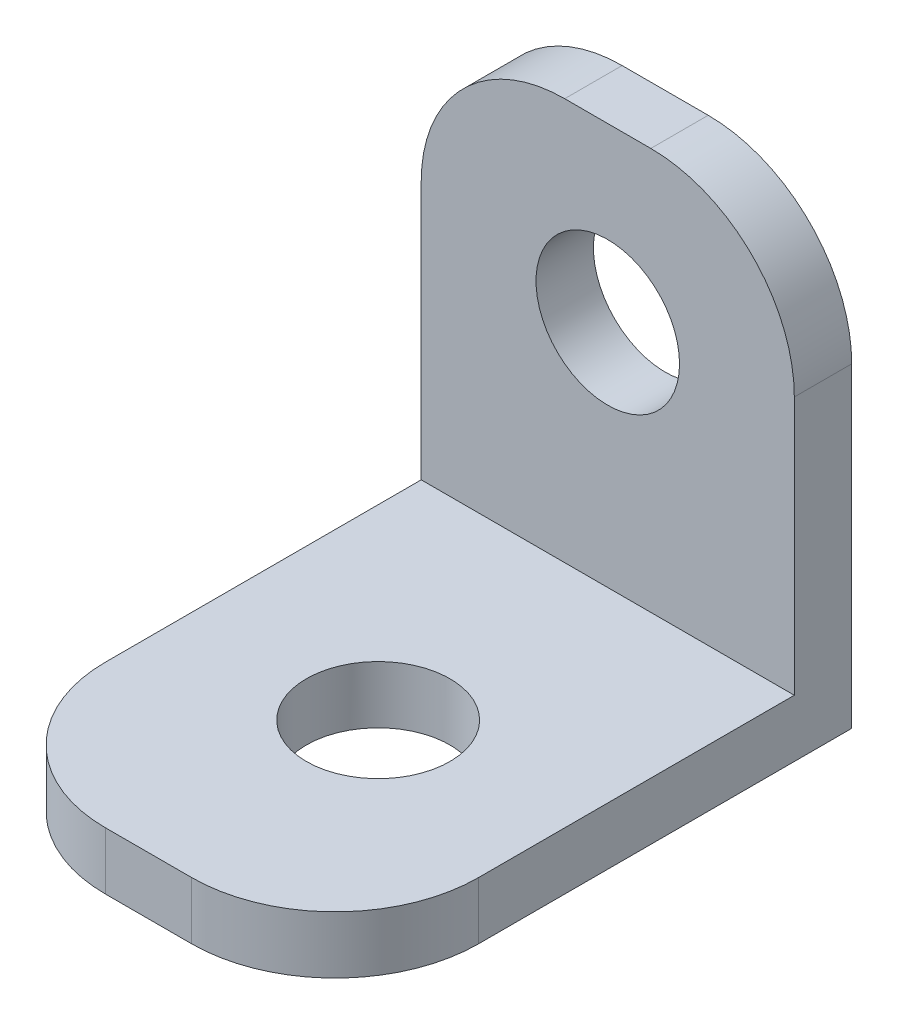
ISO-10303-21;
HEADER;
FILE_DESCRIPTION(('STEP AP214'),'2;1');
FILE_NAME('part.step','',(''),(''),'','','');
FILE_SCHEMA(('AUTOMOTIVE_DESIGN { 1 0 10303 214 1 1 1 1 }'));
ENDSEC;
DATA;
#1=APPLICATION_CONTEXT('core data for automotive mechanical design processes');
#2=APPLICATION_PROTOCOL_DEFINITION('international standard','automotive_design',2000,#1);
#3=PRODUCT_CONTEXT('',#1,'mechanical');
#4=PRODUCT('Part','Part','',(#3));
#5=PRODUCT_RELATED_PRODUCT_CATEGORY('part','',(#4));
#6=PRODUCT_DEFINITION_FORMATION('','',#4);
#7=PRODUCT_DEFINITION_CONTEXT('part definition',#1,'design');
#8=PRODUCT_DEFINITION('design','',#6,#7);
#9=PRODUCT_DEFINITION_SHAPE('','',#8);
#10=(LENGTH_UNIT() NAMED_UNIT(*) SI_UNIT(.MILLI.,.METRE.));
#11=(NAMED_UNIT(*) PLANE_ANGLE_UNIT() SI_UNIT($,.RADIAN.));
#12=(NAMED_UNIT(*) SI_UNIT($,.STERADIAN.) SOLID_ANGLE_UNIT());
#13=UNCERTAINTY_MEASURE_WITH_UNIT(LENGTH_MEASURE(1.E-05),#10,'distance_accuracy_value','');
#14=(GEOMETRIC_REPRESENTATION_CONTEXT(3) GLOBAL_UNCERTAINTY_ASSIGNED_CONTEXT((#13)) GLOBAL_UNIT_ASSIGNED_CONTEXT((#10,
#11,#12)) REPRESENTATION_CONTEXT('',''));
#15=CARTESIAN_POINT('',(0.,0.,0.));
#16=DIRECTION('',(0.,0.,1.));
#17=DIRECTION('',(1.,0.,0.));
#18=AXIS2_PLACEMENT_3D('',#15,#16,#17);
#19=CARTESIAN_POINT('',(0.,0.,2.));
#20=DIRECTION('',(0.,0.,1.));
#21=DIRECTION('',(1.,0.,0.));
#22=AXIS2_PLACEMENT_3D('',#19,#20,#21);
#23=PLANE('',#22);
#24=DIRECTION('',(-1.,0.,0.));
#25=VECTOR('',#24,1.);
#26=CARTESIAN_POINT('',(-6.5,-6.,2.));
#27=LINE('',#26,#25);
#28=CARTESIAN_POINT('',(6.5,-6.,2.));
#29=VERTEX_POINT('',#28);
#30=CARTESIAN_POINT('',(-6.5,-6.,2.));
#31=VERTEX_POINT('',#30);
#32=EDGE_CURVE('E126',#29,#31,#27,.T.);
#33=ORIENTED_EDGE('',*,*,#32,.F.);
#34=DIRECTION('',(0.,1.,0.));
#35=VECTOR('',#34,1.);
#36=CARTESIAN_POINT('',(6.5,-8.,2.));
#37=LINE('',#36,#35);
#38=CARTESIAN_POINT('',(6.5,3.,2.));
#39=VERTEX_POINT('',#38);
#40=EDGE_CURVE('E131',#29,#39,#37,.T.);
#41=ORIENTED_EDGE('',*,*,#40,.T.);
#42=CARTESIAN_POINT('',(1.5,3.,2.));
#43=DIRECTION('',(0.,0.,1.));
#44=DIRECTION('',(1.,0.,0.));
#45=AXIS2_PLACEMENT_3D('',#42,#43,#44);
#46=CIRCLE('',#45,5.);
#47=CARTESIAN_POINT('',(1.5,8.,2.));
#48=VERTEX_POINT('',#47);
#49=EDGE_CURVE('E182',#39,#48,#46,.T.);
#50=ORIENTED_EDGE('',*,*,#49,.T.);
#51=DIRECTION('',(-1.,0.,0.));
#52=VECTOR('',#51,1.);
#53=CARTESIAN_POINT('',(6.5,8.,2.));
#54=LINE('',#53,#52);
#55=CARTESIAN_POINT('',(-1.5,8.,2.));
#56=VERTEX_POINT('',#55);
#57=EDGE_CURVE('E155',#48,#56,#54,.T.);
#58=ORIENTED_EDGE('',*,*,#57,.T.);
#59=CARTESIAN_POINT('',(-1.5,3.,2.));
#60=DIRECTION('',(0.,0.,1.));
#61=DIRECTION('',(1.,0.,0.));
#62=AXIS2_PLACEMENT_3D('',#59,#60,#61);
#63=CIRCLE('',#62,5.);
#64=CARTESIAN_POINT('',(-6.5,3.,2.));
#65=VERTEX_POINT('',#64);
#66=EDGE_CURVE('E130',#56,#65,#63,.T.);
#67=ORIENTED_EDGE('',*,*,#66,.T.);
#68=DIRECTION('',(0.,-1.,0.));
#69=VECTOR('',#68,1.);
#70=CARTESIAN_POINT('',(-6.5,-8.,2.));
#71=LINE('',#70,#69);
#72=EDGE_CURVE('E114',#65,#31,#71,.T.);
#73=ORIENTED_EDGE('',*,*,#72,.T.);
#74=EDGE_LOOP('',(#33,#41,#50,#58,#67,#73));
#75=FACE_BOUND('',#74,.T.);
#76=CARTESIAN_POINT('',(0.,2.,2.));
#77=DIRECTION('',(0.,0.,1.));
#78=DIRECTION('',(1.,0.,0.));
#79=AXIS2_PLACEMENT_3D('',#76,#77,#78);
#80=CIRCLE('',#79,2.5);
#81=CARTESIAN_POINT('',(2.5,2.,2.));
#82=VERTEX_POINT('',#81);
#83=EDGE_CURVE('E148',#82,#82,#80,.T.);
#84=ORIENTED_EDGE('',*,*,#83,.F.);
#85=EDGE_LOOP('',(#84));
#86=FACE_BOUND('',#85,.T.);
#87=ADVANCED_FACE('F33',(#75,#86),#23,.T.);
#88=CARTESIAN_POINT('',(0.,0.,0.));
#89=DIRECTION('',(0.,0.,1.));
#90=DIRECTION('',(1.,0.,0.));
#91=AXIS2_PLACEMENT_3D('',#88,#89,#90);
#92=PLANE('',#91);
#93=DIRECTION('',(0.,-1.,0.));
#94=VECTOR('',#93,1.);
#95=CARTESIAN_POINT('',(-6.5,-8.,0.));
#96=LINE('',#95,#94);
#97=CARTESIAN_POINT('',(-6.5,3.,0.));
#98=VERTEX_POINT('',#97);
#99=CARTESIAN_POINT('',(-6.5,-8.,0.));
#100=VERTEX_POINT('',#99);
#101=EDGE_CURVE('E151',#98,#100,#96,.T.);
#102=ORIENTED_EDGE('',*,*,#101,.F.);
#103=CARTESIAN_POINT('',(-1.5,3.,0.));
#104=DIRECTION('',(0.,0.,1.));
#105=DIRECTION('',(1.,0.,0.));
#106=AXIS2_PLACEMENT_3D('',#103,#104,#105);
#107=CIRCLE('',#106,5.);
#108=CARTESIAN_POINT('',(-1.5,8.,0.));
#109=VERTEX_POINT('',#108);
#110=EDGE_CURVE('E175',#98,#109,#107,.F.);
#111=ORIENTED_EDGE('',*,*,#110,.T.);
#112=DIRECTION('',(-1.,0.,0.));
#113=VECTOR('',#112,1.);
#114=CARTESIAN_POINT('',(6.5,8.,0.));
#115=LINE('',#114,#113);
#116=CARTESIAN_POINT('',(1.5,8.,0.));
#117=VERTEX_POINT('',#116);
#118=EDGE_CURVE('E132',#117,#109,#115,.T.);
#119=ORIENTED_EDGE('',*,*,#118,.F.);
#120=CARTESIAN_POINT('',(1.5,3.,0.));
#121=DIRECTION('',(0.,0.,1.));
#122=DIRECTION('',(1.,0.,0.));
#123=AXIS2_PLACEMENT_3D('',#120,#121,#122);
#124=CIRCLE('',#123,5.);
#125=CARTESIAN_POINT('',(6.5,3.,0.));
#126=VERTEX_POINT('',#125);
#127=EDGE_CURVE('E173',#117,#126,#124,.F.);
#128=ORIENTED_EDGE('',*,*,#127,.T.);
#129=DIRECTION('',(0.,1.,0.));
#130=VECTOR('',#129,1.);
#131=CARTESIAN_POINT('',(6.5,-8.,0.));
#132=LINE('',#131,#130);
#133=CARTESIAN_POINT('',(6.5,-8.,0.));
#134=VERTEX_POINT('',#133);
#135=EDGE_CURVE('E163',#134,#126,#132,.T.);
#136=ORIENTED_EDGE('',*,*,#135,.F.);
#137=DIRECTION('',(1.,0.,0.));
#138=VECTOR('',#137,1.);
#139=CARTESIAN_POINT('',(6.5,-8.,0.));
#140=LINE('',#139,#138);
#141=EDGE_CURVE('E160',#100,#134,#140,.T.);
#142=ORIENTED_EDGE('',*,*,#141,.F.);
#143=EDGE_LOOP('',(#102,#111,#119,#128,#136,#142));
#144=FACE_BOUND('',#143,.T.);
#145=CARTESIAN_POINT('',(0.,2.,0.));
#146=DIRECTION('',(0.,0.,1.));
#147=DIRECTION('',(1.,0.,0.));
#148=AXIS2_PLACEMENT_3D('',#145,#146,#147);
#149=CIRCLE('',#148,2.5);
#150=CARTESIAN_POINT('',(2.5,2.,0.));
#151=VERTEX_POINT('',#150);
#152=EDGE_CURVE('E147',#151,#151,#149,.T.);
#153=ORIENTED_EDGE('',*,*,#152,.T.);
#154=EDGE_LOOP('',(#153));
#155=FACE_BOUND('',#154,.T.);
#156=ADVANCED_FACE('F222',(#144,#155),#92,.F.);
#157=CARTESIAN_POINT('',(-6.5,-8.,2.));
#158=DIRECTION('',(1.,0.,0.));
#159=DIRECTION('',(0.,0.,-1.));
#160=AXIS2_PLACEMENT_3D('',#157,#158,#159);
#161=PLANE('',#160);
#162=DIRECTION('',(0.,0.,-1.));
#163=VECTOR('',#162,1.);
#164=CARTESIAN_POINT('',(-6.5,-8.,2.));
#165=LINE('',#164,#163);
#166=CARTESIAN_POINT('',(-6.5,-8.,13.));
#167=VERTEX_POINT('',#166);
#168=EDGE_CURVE('E169',#167,#100,#165,.T.);
#169=ORIENTED_EDGE('',*,*,#168,.F.);
#170=DIRECTION('',(0.,-1.,0.));
#171=VECTOR('',#170,1.);
#172=CARTESIAN_POINT('',(-6.5,-8.,13.));
#173=LINE('',#172,#171);
#174=CARTESIAN_POINT('',(-6.5,-6.,13.));
#175=VERTEX_POINT('',#174);
#176=EDGE_CURVE('E11',#167,#175,#173,.F.);
#177=ORIENTED_EDGE('',*,*,#176,.T.);
#178=DIRECTION('',(0.,0.,-1.));
#179=VECTOR('',#178,1.);
#180=CARTESIAN_POINT('',(-6.5,-6.,18.));
#181=LINE('',#180,#179);
#182=EDGE_CURVE('E110',#175,#31,#181,.T.);
#183=ORIENTED_EDGE('',*,*,#182,.T.);
#184=ORIENTED_EDGE('',*,*,#72,.F.);
#185=DIRECTION('',(0.,0.,-1.));
#186=VECTOR('',#185,1.);
#187=CARTESIAN_POINT('',(-6.5,3.,2.));
#188=LINE('',#187,#186);
#189=EDGE_CURVE('E171',#65,#98,#188,.T.);
#190=ORIENTED_EDGE('',*,*,#189,.T.);
#191=ORIENTED_EDGE('',*,*,#101,.T.);
#192=EDGE_LOOP('',(#169,#177,#183,#184,#190,#191));
#193=FACE_BOUND('',#192,.T.);
#194=ADVANCED_FACE('F112',(#193),#161,.F.);
#195=CARTESIAN_POINT('',(6.5,-8.,2.));
#196=DIRECTION('',(0.,1.,0.));
#197=DIRECTION('',(-1.,0.,0.));
#198=AXIS2_PLACEMENT_3D('',#195,#196,#197);
#199=PLANE('',#198);
#200=CARTESIAN_POINT('',(0.,-8.,10.));
#201=DIRECTION('',(0.,1.,0.));
#202=DIRECTION('',(-1.,0.,0.));
#203=AXIS2_PLACEMENT_3D('',#200,#201,#202);
#204=CIRCLE('',#203,2.5);
#205=CARTESIAN_POINT('',(-2.5,-8.,10.));
#206=VERTEX_POINT('',#205);
#207=EDGE_CURVE('E137',#206,#206,#204,.T.);
#208=ORIENTED_EDGE('',*,*,#207,.T.);
#209=EDGE_LOOP('',(#208));
#210=FACE_BOUND('',#209,.T.);
#211=DIRECTION('',(0.,0.,-1.));
#212=VECTOR('',#211,1.);
#213=CARTESIAN_POINT('',(6.5,-8.,2.));
#214=LINE('',#213,#212);
#215=CARTESIAN_POINT('',(6.5,-8.,13.));
#216=VERTEX_POINT('',#215);
#217=EDGE_CURVE('E157',#216,#134,#214,.T.);
#218=ORIENTED_EDGE('',*,*,#217,.F.);
#219=CARTESIAN_POINT('',(1.5,-8.,13.));
#220=DIRECTION('',(0.,1.,0.));
#221=DIRECTION('',(-1.,0.,0.));
#222=AXIS2_PLACEMENT_3D('',#219,#220,#221);
#223=CIRCLE('',#222,5.);
#224=CARTESIAN_POINT('',(1.5,-8.,18.));
#225=VERTEX_POINT('',#224);
#226=EDGE_CURVE('E41',#216,#225,#223,.F.);
#227=ORIENTED_EDGE('',*,*,#226,.T.);
#228=DIRECTION('',(1.,0.,0.));
#229=VECTOR('',#228,1.);
#230=CARTESIAN_POINT('',(-6.5,-8.,18.));
#231=LINE('',#230,#229);
#232=CARTESIAN_POINT('',(-1.5,-8.,18.));
#233=VERTEX_POINT('',#232);
#234=EDGE_CURVE('E136',#233,#225,#231,.T.);
#235=ORIENTED_EDGE('',*,*,#234,.F.);
#236=CARTESIAN_POINT('',(-1.5,-8.,13.));
#237=DIRECTION('',(0.,1.,0.));
#238=DIRECTION('',(-1.,0.,0.));
#239=AXIS2_PLACEMENT_3D('',#236,#237,#238);
#240=CIRCLE('',#239,5.);
#241=EDGE_CURVE('E48',#233,#167,#240,.F.);
#242=ORIENTED_EDGE('',*,*,#241,.T.);
#243=ORIENTED_EDGE('',*,*,#168,.T.);
#244=ORIENTED_EDGE('',*,*,#141,.T.);
#245=EDGE_LOOP('',(#218,#227,#235,#242,#243,#244));
#246=FACE_BOUND('',#245,.T.);
#247=ADVANCED_FACE('F200',(#210,#246),#199,.F.);
#248=CARTESIAN_POINT('',(6.5,-8.,2.));
#249=DIRECTION('',(-1.,0.,0.));
#250=DIRECTION('',(0.,0.,1.));
#251=AXIS2_PLACEMENT_3D('',#248,#249,#250);
#252=PLANE('',#251);
#253=DIRECTION('',(0.,0.,-1.));
#254=VECTOR('',#253,1.);
#255=CARTESIAN_POINT('',(6.5,-6.,18.));
#256=LINE('',#255,#254);
#257=CARTESIAN_POINT('',(6.5,-6.,13.));
#258=VERTEX_POINT('',#257);
#259=EDGE_CURVE('E120',#258,#29,#256,.T.);
#260=ORIENTED_EDGE('',*,*,#259,.F.);
#261=DIRECTION('',(0.,1.,0.));
#262=VECTOR('',#261,1.);
#263=CARTESIAN_POINT('',(6.5,-8.,13.));
#264=LINE('',#263,#262);
#265=EDGE_CURVE('E56',#258,#216,#264,.F.);
#266=ORIENTED_EDGE('',*,*,#265,.T.);
#267=ORIENTED_EDGE('',*,*,#217,.T.);
#268=ORIENTED_EDGE('',*,*,#135,.T.);
#269=DIRECTION('',(0.,0.,-1.));
#270=VECTOR('',#269,1.);
#271=CARTESIAN_POINT('',(6.5,3.,2.));
#272=LINE('',#271,#270);
#273=EDGE_CURVE('E185',#126,#39,#272,.F.);
#274=ORIENTED_EDGE('',*,*,#273,.T.);
#275=ORIENTED_EDGE('',*,*,#40,.F.);
#276=EDGE_LOOP('',(#260,#266,#267,#268,#274,#275));
#277=FACE_BOUND('',#276,.T.);
#278=ADVANCED_FACE('F208',(#277),#252,.F.);
#279=CARTESIAN_POINT('',(6.5,8.,2.));
#280=DIRECTION('',(0.,-1.,0.));
#281=DIRECTION('',(0.,0.,-1.));
#282=AXIS2_PLACEMENT_3D('',#279,#280,#281);
#283=PLANE('',#282);
#284=ORIENTED_EDGE('',*,*,#118,.T.);
#285=DIRECTION('',(0.,0.,-1.));
#286=VECTOR('',#285,1.);
#287=CARTESIAN_POINT('',(-1.5,8.,2.));
#288=LINE('',#287,#286);
#289=EDGE_CURVE('E180',#109,#56,#288,.F.);
#290=ORIENTED_EDGE('',*,*,#289,.T.);
#291=ORIENTED_EDGE('',*,*,#57,.F.);
#292=DIRECTION('',(0.,0.,-1.));
#293=VECTOR('',#292,1.);
#294=CARTESIAN_POINT('',(1.5,8.,2.));
#295=LINE('',#294,#293);
#296=EDGE_CURVE('E177',#48,#117,#295,.T.);
#297=ORIENTED_EDGE('',*,*,#296,.T.);
#298=EDGE_LOOP('',(#284,#290,#291,#297));
#299=FACE_BOUND('',#298,.T.);
#300=ADVANCED_FACE('F215',(#299),#283,.F.);
#301=CARTESIAN_POINT('',(0.,2.,2.));
#302=DIRECTION('',(0.,0.,-1.));
#303=DIRECTION('',(-1.,0.,0.));
#304=AXIS2_PLACEMENT_3D('',#301,#302,#303);
#305=CYLINDRICAL_SURFACE('',#304,2.5);
#306=ORIENTED_EDGE('',*,*,#83,.T.);
#307=EDGE_LOOP('',(#306));
#308=FACE_BOUND('',#307,.T.);
#309=ORIENTED_EDGE('',*,*,#152,.F.);
#310=EDGE_LOOP('',(#309));
#311=FACE_BOUND('',#310,.T.);
#312=ADVANCED_FACE('F228',(#308,#311),#305,.F.);
#313=CARTESIAN_POINT('',(-1.5,3.,2.));
#314=DIRECTION('',(0.,0.,-1.));
#315=DIRECTION('',(-1.,0.,0.));
#316=AXIS2_PLACEMENT_3D('',#313,#314,#315);
#317=CYLINDRICAL_SURFACE('',#316,5.);
#318=ORIENTED_EDGE('',*,*,#66,.F.);
#319=ORIENTED_EDGE('',*,*,#289,.F.);
#320=ORIENTED_EDGE('',*,*,#110,.F.);
#321=ORIENTED_EDGE('',*,*,#189,.F.);
#322=EDGE_LOOP('',(#318,#319,#320,#321));
#323=FACE_BOUND('',#322,.T.);
#324=ADVANCED_FACE('F226',(#323),#317,.T.);
#325=CARTESIAN_POINT('',(1.5,3.,2.));
#326=DIRECTION('',(0.,0.,-1.));
#327=DIRECTION('',(-1.,0.,0.));
#328=AXIS2_PLACEMENT_3D('',#325,#326,#327);
#329=CYLINDRICAL_SURFACE('',#328,5.);
#330=ORIENTED_EDGE('',*,*,#49,.F.);
#331=ORIENTED_EDGE('',*,*,#273,.F.);
#332=ORIENTED_EDGE('',*,*,#127,.F.);
#333=ORIENTED_EDGE('',*,*,#296,.F.);
#334=EDGE_LOOP('',(#330,#331,#332,#333));
#335=FACE_BOUND('',#334,.T.);
#336=ADVANCED_FACE('F218',(#335),#329,.T.);
#337=CARTESIAN_POINT('',(-6.5,-6.,18.));
#338=DIRECTION('',(0.,-1.,0.));
#339=DIRECTION('',(0.,0.,-1.));
#340=AXIS2_PLACEMENT_3D('',#337,#338,#339);
#341=PLANE('',#340);
#342=CARTESIAN_POINT('',(0.,-6.,10.));
#343=DIRECTION('',(0.,1.,0.));
#344=DIRECTION('',(0.,0.,1.));
#345=AXIS2_PLACEMENT_3D('',#342,#343,#344);
#346=CIRCLE('',#345,2.5);
#347=CARTESIAN_POINT('',(0.,-6.,12.5));
#348=VERTEX_POINT('',#347);
#349=EDGE_CURVE('E142',#348,#348,#346,.T.);
#350=ORIENTED_EDGE('',*,*,#349,.F.);
#351=EDGE_LOOP('',(#350));
#352=FACE_BOUND('',#351,.T.);
#353=DIRECTION('',(-1.,0.,0.));
#354=VECTOR('',#353,1.);
#355=CARTESIAN_POINT('',(-6.5,-6.,18.));
#356=LINE('',#355,#354);
#357=CARTESIAN_POINT('',(1.5,-6.,18.));
#358=VERTEX_POINT('',#357);
#359=CARTESIAN_POINT('',(-1.5,-6.,18.));
#360=VERTEX_POINT('',#359);
#361=EDGE_CURVE('E121',#358,#360,#356,.T.);
#362=ORIENTED_EDGE('',*,*,#361,.F.);
#363=CARTESIAN_POINT('',(1.5,-6.,13.));
#364=DIRECTION('',(0.,-1.,0.));
#365=DIRECTION('',(0.,0.,-1.));
#366=AXIS2_PLACEMENT_3D('',#363,#364,#365);
#367=CIRCLE('',#366,5.);
#368=EDGE_CURVE('E196',#358,#258,#367,.F.);
#369=ORIENTED_EDGE('',*,*,#368,.T.);
#370=ORIENTED_EDGE('',*,*,#259,.T.);
#371=ORIENTED_EDGE('',*,*,#32,.T.);
#372=ORIENTED_EDGE('',*,*,#182,.F.);
#373=CARTESIAN_POINT('',(-1.5,-6.,13.));
#374=DIRECTION('',(0.,-1.,0.));
#375=DIRECTION('',(0.,0.,-1.));
#376=AXIS2_PLACEMENT_3D('',#373,#374,#375);
#377=CIRCLE('',#376,5.);
#378=EDGE_CURVE('E194',#175,#360,#377,.F.);
#379=ORIENTED_EDGE('',*,*,#378,.T.);
#380=EDGE_LOOP('',(#362,#369,#370,#371,#372,#379));
#381=FACE_BOUND('',#380,.T.);
#382=ADVANCED_FACE('F135',(#352,#381),#341,.F.);
#383=CARTESIAN_POINT('',(0.,0.,18.));
#384=DIRECTION('',(0.,0.,-1.));
#385=DIRECTION('',(-1.,0.,0.));
#386=AXIS2_PLACEMENT_3D('',#383,#384,#385);
#387=PLANE('',#386);
#388=ORIENTED_EDGE('',*,*,#234,.T.);
#389=DIRECTION('',(0.,1.,0.));
#390=VECTOR('',#389,1.);
#391=CARTESIAN_POINT('',(1.5,0.,18.));
#392=LINE('',#391,#390);
#393=EDGE_CURVE('E191',#225,#358,#392,.T.);
#394=ORIENTED_EDGE('',*,*,#393,.T.);
#395=ORIENTED_EDGE('',*,*,#361,.T.);
#396=DIRECTION('',(0.,-1.,0.));
#397=VECTOR('',#396,1.);
#398=CARTESIAN_POINT('',(-1.5,0.,18.));
#399=LINE('',#398,#397);
#400=EDGE_CURVE('E188',#360,#233,#399,.T.);
#401=ORIENTED_EDGE('',*,*,#400,.T.);
#402=EDGE_LOOP('',(#388,#394,#395,#401));
#403=FACE_BOUND('',#402,.T.);
#404=ADVANCED_FACE('F204',(#403),#387,.F.);
#405=CARTESIAN_POINT('',(1.5,0.,13.));
#406=DIRECTION('',(0.,1.,0.));
#407=DIRECTION('',(0.,0.,1.));
#408=AXIS2_PLACEMENT_3D('',#405,#406,#407);
#409=CYLINDRICAL_SURFACE('',#408,5.);
#410=ORIENTED_EDGE('',*,*,#226,.F.);
#411=ORIENTED_EDGE('',*,*,#265,.F.);
#412=ORIENTED_EDGE('',*,*,#368,.F.);
#413=ORIENTED_EDGE('',*,*,#393,.F.);
#414=EDGE_LOOP('',(#410,#411,#412,#413));
#415=FACE_BOUND('',#414,.T.);
#416=ADVANCED_FACE('F207',(#415),#409,.T.);
#417=CARTESIAN_POINT('',(-1.5,0.,13.));
#418=DIRECTION('',(0.,-1.,0.));
#419=DIRECTION('',(0.,0.,-1.));
#420=AXIS2_PLACEMENT_3D('',#417,#418,#419);
#421=CYLINDRICAL_SURFACE('',#420,5.);
#422=ORIENTED_EDGE('',*,*,#378,.F.);
#423=ORIENTED_EDGE('',*,*,#176,.F.);
#424=ORIENTED_EDGE('',*,*,#241,.F.);
#425=ORIENTED_EDGE('',*,*,#400,.F.);
#426=EDGE_LOOP('',(#422,#423,#424,#425));
#427=FACE_BOUND('',#426,.T.);
#428=ADVANCED_FACE('F35',(#427),#421,.T.);
#429=CARTESIAN_POINT('',(0.,-22.,10.));
#430=DIRECTION('',(0.,1.,0.));
#431=DIRECTION('',(0.,0.,1.));
#432=AXIS2_PLACEMENT_3D('',#429,#430,#431);
#433=CYLINDRICAL_SURFACE('',#432,2.5);
#434=ORIENTED_EDGE('',*,*,#349,.T.);
#435=EDGE_LOOP('',(#434));
#436=FACE_BOUND('',#435,.T.);
#437=ORIENTED_EDGE('',*,*,#207,.F.);
#438=EDGE_LOOP('',(#437));
#439=FACE_BOUND('',#438,.T.);
#440=ADVANCED_FACE('F330',(#436,#439),#433,.F.);
#441=CLOSED_SHELL('',(#87,#156,#194,#247,#278,#300,#312,#324,#336,#382,#404,#416,#428,#440));
#442=MANIFOLD_SOLID_BREP('B2',#441);
#443=ADVANCED_BREP_SHAPE_REPRESENTATION('',(#18,#442),#14);
#444=SHAPE_DEFINITION_REPRESENTATION(#9,#443);
ENDSEC;
END-ISO-10303-21;
